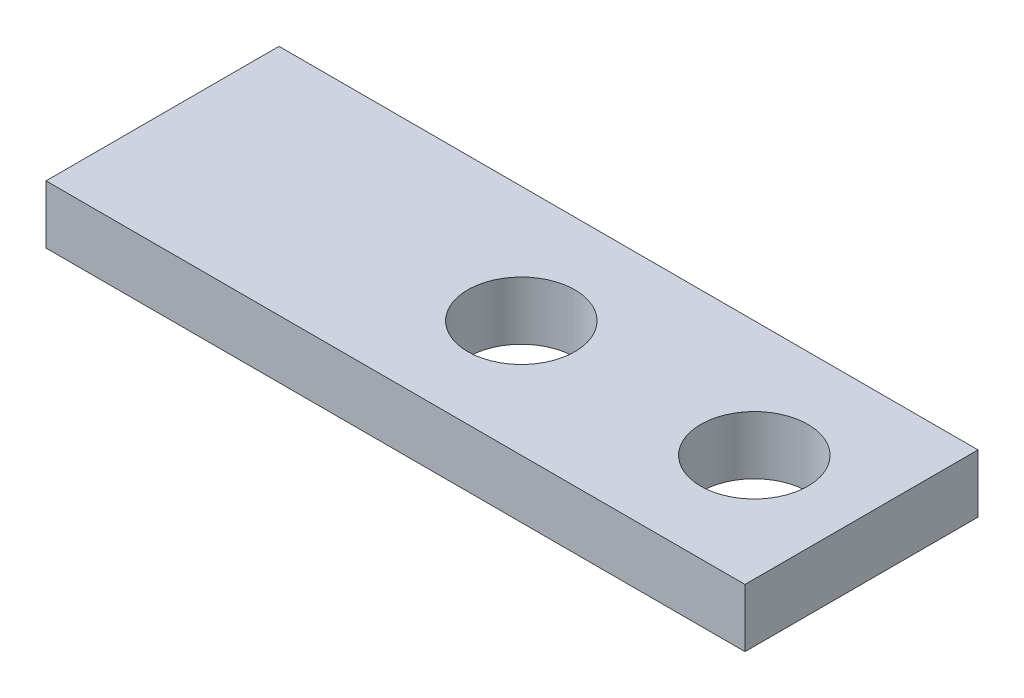
ISO-10303-21;
HEADER;
FILE_DESCRIPTION(('STEP AP214'),'2;1');
FILE_NAME('part.step','',(''),(''),'','','');
FILE_SCHEMA(('AUTOMOTIVE_DESIGN { 1 0 10303 214 1 1 1 1 }'));
ENDSEC;
DATA;
#1=APPLICATION_CONTEXT('core data for automotive mechanical design processes');
#2=APPLICATION_PROTOCOL_DEFINITION('international standard','automotive_design',2000,#1);
#3=PRODUCT_CONTEXT('',#1,'mechanical');
#4=PRODUCT('Part','Part','',(#3));
#5=PRODUCT_RELATED_PRODUCT_CATEGORY('part','',(#4));
#6=PRODUCT_DEFINITION_FORMATION('','',#4);
#7=PRODUCT_DEFINITION_CONTEXT('part definition',#1,'design');
#8=PRODUCT_DEFINITION('design','',#6,#7);
#9=PRODUCT_DEFINITION_SHAPE('','',#8);
#10=(LENGTH_UNIT() NAMED_UNIT(*) SI_UNIT(.MILLI.,.METRE.));
#11=(NAMED_UNIT(*) PLANE_ANGLE_UNIT() SI_UNIT($,.RADIAN.));
#12=(NAMED_UNIT(*) SI_UNIT($,.STERADIAN.) SOLID_ANGLE_UNIT());
#13=UNCERTAINTY_MEASURE_WITH_UNIT(LENGTH_MEASURE(1.E-05),#10,'distance_accuracy_value','');
#14=(GEOMETRIC_REPRESENTATION_CONTEXT(3) GLOBAL_UNCERTAINTY_ASSIGNED_CONTEXT((#13)) GLOBAL_UNIT_ASSIGNED_CONTEXT((#10,
#11,#12)) REPRESENTATION_CONTEXT('',''));
#15=CARTESIAN_POINT('',(0.,0.,0.));
#16=DIRECTION('',(0.,0.,1.));
#17=DIRECTION('',(1.,0.,0.));
#18=AXIS2_PLACEMENT_3D('',#15,#16,#17);
#19=CARTESIAN_POINT('',(0.,6.35,0.));
#20=DIRECTION('',(0.,-1.,0.));
#21=DIRECTION('',(0.,0.,-1.));
#22=AXIS2_PLACEMENT_3D('',#19,#20,#21);
#23=PLANE('',#22);
#24=DIRECTION('',(0.,0.,-1.));
#25=VECTOR('',#24,1.);
#26=CARTESIAN_POINT('',(38.1,6.35,12.7));
#27=LINE('',#26,#25);
#28=CARTESIAN_POINT('',(38.1,6.35,12.7));
#29=VERTEX_POINT('',#28);
#30=CARTESIAN_POINT('',(38.1,6.35,-12.7));
#31=VERTEX_POINT('',#30);
#32=EDGE_CURVE('E98',#29,#31,#27,.T.);
#33=ORIENTED_EDGE('',*,*,#32,.T.);
#34=DIRECTION('',(-1.,0.,0.));
#35=VECTOR('',#34,1.);
#36=CARTESIAN_POINT('',(-38.1,6.35,-12.7));
#37=LINE('',#36,#35);
#38=CARTESIAN_POINT('',(-38.1,6.35,-12.7));
#39=VERTEX_POINT('',#38);
#40=EDGE_CURVE('E93',#31,#39,#37,.T.);
#41=ORIENTED_EDGE('',*,*,#40,.T.);
#42=DIRECTION('',(0.,0.,1.));
#43=VECTOR('',#42,1.);
#44=CARTESIAN_POINT('',(-38.1,6.35,12.7));
#45=LINE('',#44,#43);
#46=CARTESIAN_POINT('',(-38.1,6.35,12.7));
#47=VERTEX_POINT('',#46);
#48=EDGE_CURVE('E96',#39,#47,#45,.T.);
#49=ORIENTED_EDGE('',*,*,#48,.T.);
#50=DIRECTION('',(1.,0.,0.));
#51=VECTOR('',#50,1.);
#52=CARTESIAN_POINT('',(-38.1,6.35,12.7));
#53=LINE('',#52,#51);
#54=EDGE_CURVE('E63',#47,#29,#53,.T.);
#55=ORIENTED_EDGE('',*,*,#54,.T.);
#56=EDGE_LOOP('',(#33,#41,#49,#55));
#57=FACE_BOUND('',#56,.T.);
#58=CARTESIAN_POINT('',(26.416,6.35,0.));
#59=DIRECTION('',(0.,1.,0.));
#60=DIRECTION('',(0.,0.,1.));
#61=AXIS2_PLACEMENT_3D('',#58,#59,#60);
#62=CIRCLE('',#61,5.842);
#63=CARTESIAN_POINT('',(26.416,6.35,5.842));
#64=VERTEX_POINT('',#63);
#65=EDGE_CURVE('E118',#64,#64,#62,.T.);
#66=ORIENTED_EDGE('',*,*,#65,.F.);
#67=EDGE_LOOP('',(#66));
#68=FACE_BOUND('',#67,.T.);
#69=CARTESIAN_POINT('',(1.016,6.35,0.));
#70=DIRECTION('',(0.,1.,0.));
#71=DIRECTION('',(0.,0.,1.));
#72=AXIS2_PLACEMENT_3D('',#69,#70,#71);
#73=CIRCLE('',#72,5.842);
#74=CARTESIAN_POINT('',(1.016,6.35,5.842));
#75=VERTEX_POINT('',#74);
#76=EDGE_CURVE('E140',#75,#75,#73,.T.);
#77=ORIENTED_EDGE('',*,*,#76,.F.);
#78=EDGE_LOOP('',(#77));
#79=FACE_BOUND('',#78,.T.);
#80=ADVANCED_FACE('F45',(#57,#68,#79),#23,.F.);
#81=CARTESIAN_POINT('',(0.,0.,0.));
#82=DIRECTION('',(0.,-1.,0.));
#83=DIRECTION('',(0.,0.,-1.));
#84=AXIS2_PLACEMENT_3D('',#81,#82,#83);
#85=PLANE('',#84);
#86=CARTESIAN_POINT('',(26.416,0.,0.));
#87=DIRECTION('',(0.,1.,0.));
#88=DIRECTION('',(0.,0.,1.));
#89=AXIS2_PLACEMENT_3D('',#86,#87,#88);
#90=CIRCLE('',#89,5.842);
#91=CARTESIAN_POINT('',(26.416,0.,5.842));
#92=VERTEX_POINT('',#91);
#93=EDGE_CURVE('E136',#92,#92,#90,.T.);
#94=ORIENTED_EDGE('',*,*,#93,.T.);
#95=EDGE_LOOP('',(#94));
#96=FACE_BOUND('',#95,.T.);
#97=DIRECTION('',(0.,0.,-1.));
#98=VECTOR('',#97,1.);
#99=CARTESIAN_POINT('',(38.1,0.,12.7));
#100=LINE('',#99,#98);
#101=CARTESIAN_POINT('',(38.1,0.,12.7));
#102=VERTEX_POINT('',#101);
#103=CARTESIAN_POINT('',(38.1,0.,-12.7));
#104=VERTEX_POINT('',#103);
#105=EDGE_CURVE('E114',#102,#104,#100,.T.);
#106=ORIENTED_EDGE('',*,*,#105,.F.);
#107=DIRECTION('',(1.,0.,0.));
#108=VECTOR('',#107,1.);
#109=CARTESIAN_POINT('',(-38.1,0.,12.7));
#110=LINE('',#109,#108);
#111=CARTESIAN_POINT('',(-38.1,0.,12.7));
#112=VERTEX_POINT('',#111);
#113=EDGE_CURVE('E86',#112,#102,#110,.T.);
#114=ORIENTED_EDGE('',*,*,#113,.F.);
#115=DIRECTION('',(0.,0.,1.));
#116=VECTOR('',#115,1.);
#117=CARTESIAN_POINT('',(-38.1,0.,12.7));
#118=LINE('',#117,#116);
#119=CARTESIAN_POINT('',(-38.1,0.,-12.7));
#120=VERTEX_POINT('',#119);
#121=EDGE_CURVE('E80',#120,#112,#118,.T.);
#122=ORIENTED_EDGE('',*,*,#121,.F.);
#123=DIRECTION('',(-1.,0.,0.));
#124=VECTOR('',#123,1.);
#125=CARTESIAN_POINT('',(-38.1,0.,-12.7));
#126=LINE('',#125,#124);
#127=EDGE_CURVE('E103',#104,#120,#126,.T.);
#128=ORIENTED_EDGE('',*,*,#127,.F.);
#129=EDGE_LOOP('',(#106,#114,#122,#128));
#130=FACE_BOUND('',#129,.T.);
#131=CARTESIAN_POINT('',(1.016,0.,0.));
#132=DIRECTION('',(0.,1.,0.));
#133=DIRECTION('',(0.,0.,1.));
#134=AXIS2_PLACEMENT_3D('',#131,#132,#133);
#135=CIRCLE('',#134,5.842);
#136=CARTESIAN_POINT('',(1.016,0.,5.842));
#137=VERTEX_POINT('',#136);
#138=EDGE_CURVE('E144',#137,#137,#135,.T.);
#139=ORIENTED_EDGE('',*,*,#138,.T.);
#140=EDGE_LOOP('',(#139));
#141=FACE_BOUND('',#140,.T.);
#142=ADVANCED_FACE('F131',(#96,#130,#141),#85,.T.);
#143=CARTESIAN_POINT('',(38.1,6.35,12.7));
#144=DIRECTION('',(-1.,0.,0.));
#145=DIRECTION('',(0.,0.,1.));
#146=AXIS2_PLACEMENT_3D('',#143,#144,#145);
#147=PLANE('',#146);
#148=ORIENTED_EDGE('',*,*,#105,.T.);
#149=DIRECTION('',(0.,-1.,0.));
#150=VECTOR('',#149,1.);
#151=CARTESIAN_POINT('',(38.1,6.35,-12.7));
#152=LINE('',#151,#150);
#153=EDGE_CURVE('E11',#31,#104,#152,.T.);
#154=ORIENTED_EDGE('',*,*,#153,.F.);
#155=ORIENTED_EDGE('',*,*,#32,.F.);
#156=DIRECTION('',(0.,-1.,0.));
#157=VECTOR('',#156,1.);
#158=CARTESIAN_POINT('',(38.1,6.35,12.7));
#159=LINE('',#158,#157);
#160=EDGE_CURVE('E110',#29,#102,#159,.T.);
#161=ORIENTED_EDGE('',*,*,#160,.T.);
#162=EDGE_LOOP('',(#148,#154,#155,#161));
#163=FACE_BOUND('',#162,.T.);
#164=ADVANCED_FACE('F47',(#163),#147,.F.);
#165=CARTESIAN_POINT('',(-38.1,6.35,-12.7));
#166=DIRECTION('',(0.,0.,1.));
#167=DIRECTION('',(1.,0.,0.));
#168=AXIS2_PLACEMENT_3D('',#165,#166,#167);
#169=PLANE('',#168);
#170=ORIENTED_EDGE('',*,*,#127,.T.);
#171=DIRECTION('',(0.,-1.,0.));
#172=VECTOR('',#171,1.);
#173=CARTESIAN_POINT('',(-38.1,6.35,-12.7));
#174=LINE('',#173,#172);
#175=EDGE_CURVE('E55',#39,#120,#174,.T.);
#176=ORIENTED_EDGE('',*,*,#175,.F.);
#177=ORIENTED_EDGE('',*,*,#40,.F.);
#178=ORIENTED_EDGE('',*,*,#153,.T.);
#179=EDGE_LOOP('',(#170,#176,#177,#178));
#180=FACE_BOUND('',#179,.T.);
#181=ADVANCED_FACE('F102',(#180),#169,.F.);
#182=CARTESIAN_POINT('',(-38.1,6.35,12.7));
#183=DIRECTION('',(1.,0.,0.));
#184=DIRECTION('',(0.,0.,-1.));
#185=AXIS2_PLACEMENT_3D('',#182,#183,#184);
#186=PLANE('',#185);
#187=ORIENTED_EDGE('',*,*,#121,.T.);
#188=DIRECTION('',(0.,-1.,0.));
#189=VECTOR('',#188,1.);
#190=CARTESIAN_POINT('',(-38.1,6.35,12.7));
#191=LINE('',#190,#189);
#192=EDGE_CURVE('E105',#47,#112,#191,.T.);
#193=ORIENTED_EDGE('',*,*,#192,.F.);
#194=ORIENTED_EDGE('',*,*,#48,.F.);
#195=ORIENTED_EDGE('',*,*,#175,.T.);
#196=EDGE_LOOP('',(#187,#193,#194,#195));
#197=FACE_BOUND('',#196,.T.);
#198=ADVANCED_FACE('F106',(#197),#186,.F.);
#199=CARTESIAN_POINT('',(-38.1,6.35,12.7));
#200=DIRECTION('',(0.,0.,-1.));
#201=DIRECTION('',(-1.,0.,0.));
#202=AXIS2_PLACEMENT_3D('',#199,#200,#201);
#203=PLANE('',#202);
#204=ORIENTED_EDGE('',*,*,#113,.T.);
#205=ORIENTED_EDGE('',*,*,#160,.F.);
#206=ORIENTED_EDGE('',*,*,#54,.F.);
#207=ORIENTED_EDGE('',*,*,#192,.T.);
#208=EDGE_LOOP('',(#204,#205,#206,#207));
#209=FACE_BOUND('',#208,.T.);
#210=ADVANCED_FACE('F128',(#209),#203,.F.);
#211=CARTESIAN_POINT('',(26.416,6.35,0.));
#212=DIRECTION('',(0.,-1.,0.));
#213=DIRECTION('',(0.,0.,-1.));
#214=AXIS2_PLACEMENT_3D('',#211,#212,#213);
#215=CYLINDRICAL_SURFACE('',#214,5.842);
#216=ORIENTED_EDGE('',*,*,#65,.T.);
#217=EDGE_LOOP('',(#216));
#218=FACE_BOUND('',#217,.T.);
#219=ORIENTED_EDGE('',*,*,#93,.F.);
#220=EDGE_LOOP('',(#219));
#221=FACE_BOUND('',#220,.T.);
#222=ADVANCED_FACE('F163',(#218,#221),#215,.F.);
#223=CARTESIAN_POINT('',(1.016,6.35,0.));
#224=DIRECTION('',(0.,-1.,0.));
#225=DIRECTION('',(0.,0.,-1.));
#226=AXIS2_PLACEMENT_3D('',#223,#224,#225);
#227=CYLINDRICAL_SURFACE('',#226,5.842);
#228=ORIENTED_EDGE('',*,*,#76,.T.);
#229=EDGE_LOOP('',(#228));
#230=FACE_BOUND('',#229,.T.);
#231=ORIENTED_EDGE('',*,*,#138,.F.);
#232=EDGE_LOOP('',(#231));
#233=FACE_BOUND('',#232,.T.);
#234=ADVANCED_FACE('F152',(#230,#233),#227,.F.);
#235=CLOSED_SHELL('',(#80,#142,#164,#181,#198,#210,#222,#234));
#236=MANIFOLD_SOLID_BREP('B2',#235);
#237=ADVANCED_BREP_SHAPE_REPRESENTATION('',(#18,#236),#14);
#238=SHAPE_DEFINITION_REPRESENTATION(#9,#237);
ENDSEC;
END-ISO-10303-21;
